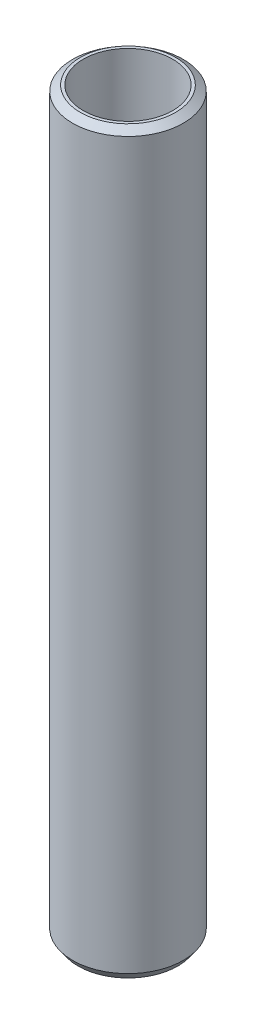
ISO-10303-21;
HEADER;
FILE_DESCRIPTION(('STEP AP214'),'2;1');
FILE_NAME('part.step','',(''),(''),'','','');
FILE_SCHEMA(('AUTOMOTIVE_DESIGN { 1 0 10303 214 1 1 1 1 }'));
ENDSEC;
DATA;
#1=APPLICATION_CONTEXT('core data for automotive mechanical design processes');
#2=APPLICATION_PROTOCOL_DEFINITION('international standard','automotive_design',2000,#1);
#3=PRODUCT_CONTEXT('',#1,'mechanical');
#4=PRODUCT('Part','Part','',(#3));
#5=PRODUCT_RELATED_PRODUCT_CATEGORY('part','',(#4));
#6=PRODUCT_DEFINITION_FORMATION('','',#4);
#7=PRODUCT_DEFINITION_CONTEXT('part definition',#1,'design');
#8=PRODUCT_DEFINITION('design','',#6,#7);
#9=PRODUCT_DEFINITION_SHAPE('','',#8);
#10=(LENGTH_UNIT() NAMED_UNIT(*) SI_UNIT(.MILLI.,.METRE.));
#11=(NAMED_UNIT(*) PLANE_ANGLE_UNIT() SI_UNIT($,.RADIAN.));
#12=(NAMED_UNIT(*) SI_UNIT($,.STERADIAN.) SOLID_ANGLE_UNIT());
#13=UNCERTAINTY_MEASURE_WITH_UNIT(LENGTH_MEASURE(1.E-05),#10,'distance_accuracy_value','');
#14=(GEOMETRIC_REPRESENTATION_CONTEXT(3) GLOBAL_UNCERTAINTY_ASSIGNED_CONTEXT((#13)) GLOBAL_UNIT_ASSIGNED_CONTEXT((#10,
#11,#12)) REPRESENTATION_CONTEXT('',''));
#15=CARTESIAN_POINT('',(0.,0.,0.));
#16=DIRECTION('',(0.,0.,1.));
#17=DIRECTION('',(1.,0.,0.));
#18=AXIS2_PLACEMENT_3D('',#15,#16,#17);
#19=CARTESIAN_POINT('',(0.,600.,0.));
#20=DIRECTION('',(0.,-1.,0.));
#21=DIRECTION('',(0.,0.,-1.));
#22=AXIS2_PLACEMENT_3D('',#19,#20,#21);
#23=CYLINDRICAL_SURFACE('',#22,45.);
#24=CARTESIAN_POINT('',(0.,595.513273647644,0.));
#25=DIRECTION('',(0.,1.,0.));
#26=DIRECTION('',(0.,0.,1.));
#27=AXIS2_PLACEMENT_3D('',#24,#25,#26);
#28=CIRCLE('',#27,45.);
#29=CARTESIAN_POINT('',(0.,595.513273647644,45.));
#30=VERTEX_POINT('',#29);
#31=EDGE_CURVE('E50',#30,#30,#28,.F.);
#32=ORIENTED_EDGE('',*,*,#31,.T.);
#33=EDGE_LOOP('',(#32));
#34=FACE_BOUND('',#33,.T.);
#35=CARTESIAN_POINT('',(0.,6.26625271174019,0.));
#36=DIRECTION('',(0.,1.,0.));
#37=DIRECTION('',(0.,0.,1.));
#38=AXIS2_PLACEMENT_3D('',#35,#36,#37);
#39=CIRCLE('',#38,45.);
#40=CARTESIAN_POINT('',(0.,6.26625271174019,45.));
#41=VERTEX_POINT('',#40);
#42=EDGE_CURVE('E51',#41,#41,#39,.T.);
#43=ORIENTED_EDGE('',*,*,#42,.T.);
#44=EDGE_LOOP('',(#43));
#45=FACE_BOUND('',#44,.T.);
#46=ADVANCED_FACE('F39',(#34,#45),#23,.T.);
#47=CARTESIAN_POINT('',(0.,600.,0.));
#48=DIRECTION('',(0.,1.,0.));
#49=DIRECTION('',(0.,0.,1.));
#50=AXIS2_PLACEMENT_3D('',#47,#48,#49);
#51=PLANE('',#50);
#52=CARTESIAN_POINT('',(0.,600.,0.));
#53=DIRECTION('',(0.,1.,0.));
#54=DIRECTION('',(0.,0.,1.));
#55=AXIS2_PLACEMENT_3D('',#52,#53,#54);
#56=CIRCLE('',#55,38.7337472882597);
#57=CARTESIAN_POINT('',(0.,600.,38.7337472882597));
#58=VERTEX_POINT('',#57);
#59=EDGE_CURVE('E54',#58,#58,#56,.T.);
#60=ORIENTED_EDGE('',*,*,#59,.T.);
#61=EDGE_LOOP('',(#60));
#62=FACE_BOUND('',#61,.T.);
#63=CARTESIAN_POINT('',(0.,600.,0.));
#64=DIRECTION('',(0.,1.,0.));
#65=DIRECTION('',(0.,0.,1.));
#66=AXIS2_PLACEMENT_3D('',#63,#64,#65);
#67=CIRCLE('',#66,36.3207869684112);
#68=CARTESIAN_POINT('',(0.,600.,36.3207869684112));
#69=VERTEX_POINT('',#68);
#70=EDGE_CURVE('E58',#69,#69,#67,.T.);
#71=ORIENTED_EDGE('',*,*,#70,.F.);
#72=EDGE_LOOP('',(#71));
#73=FACE_BOUND('',#72,.T.);
#74=ADVANCED_FACE('F69',(#62,#73),#51,.T.);
#75=CARTESIAN_POINT('',(0.,0.,0.));
#76=DIRECTION('',(0.,1.,0.));
#77=DIRECTION('',(0.,0.,1.));
#78=AXIS2_PLACEMENT_3D('',#75,#76,#77);
#79=PLANE('',#78);
#80=CARTESIAN_POINT('',(0.,0.,0.));
#81=DIRECTION('',(0.,1.,0.));
#82=DIRECTION('',(0.,0.,1.));
#83=AXIS2_PLACEMENT_3D('',#80,#81,#82);
#84=CIRCLE('',#83,40.5132736476445);
#85=CARTESIAN_POINT('',(0.,0.,40.5132736476445));
#86=VERTEX_POINT('',#85);
#87=EDGE_CURVE('E10',#86,#86,#84,.F.);
#88=ORIENTED_EDGE('',*,*,#87,.T.);
#89=EDGE_LOOP('',(#88));
#90=FACE_BOUND('',#89,.T.);
#91=CARTESIAN_POINT('',(0.,0.,0.));
#92=DIRECTION('',(0.,1.,0.));
#93=DIRECTION('',(0.,0.,1.));
#94=AXIS2_PLACEMENT_3D('',#91,#92,#93);
#95=CIRCLE('',#94,36.3207869684112);
#96=CARTESIAN_POINT('',(0.,0.,36.3207869684112));
#97=VERTEX_POINT('',#96);
#98=EDGE_CURVE('E63',#97,#97,#95,.T.);
#99=ORIENTED_EDGE('',*,*,#98,.T.);
#100=EDGE_LOOP('',(#99));
#101=FACE_BOUND('',#100,.T.);
#102=ADVANCED_FACE('F75',(#90,#101),#79,.F.);
#103=CARTESIAN_POINT('',(0.,600.,0.));
#104=DIRECTION('',(0.,-1.,0.));
#105=DIRECTION('',(0.,0.,-1.));
#106=AXIS2_PLACEMENT_3D('',#103,#104,#105);
#107=CYLINDRICAL_SURFACE('',#106,36.3207869684112);
#108=ORIENTED_EDGE('',*,*,#70,.T.);
#109=EDGE_LOOP('',(#108));
#110=FACE_BOUND('',#109,.T.);
#111=ORIENTED_EDGE('',*,*,#98,.F.);
#112=EDGE_LOOP('',(#111));
#113=FACE_BOUND('',#112,.T.);
#114=ADVANCED_FACE('F70',(#110,#113),#107,.F.);
#115=CARTESIAN_POINT('',(0.,600.,0.));
#116=DIRECTION('',(0.,-1.,0.));
#117=DIRECTION('',(0.,0.,-1.));
#118=AXIS2_PLACEMENT_3D('',#115,#116,#117);
#119=CONICAL_SURFACE('',#118,38.7337472882597,0.94940319303886);
#120=ORIENTED_EDGE('',*,*,#31,.F.);
#121=EDGE_LOOP('',(#120));
#122=FACE_BOUND('',#121,.T.);
#123=ORIENTED_EDGE('',*,*,#59,.F.);
#124=EDGE_LOOP('',(#123));
#125=FACE_BOUND('',#124,.T.);
#126=ADVANCED_FACE('F81',(#122,#125),#119,.T.);
#127=CARTESIAN_POINT('',(0.,6.26625271174019,0.));
#128=DIRECTION('',(0.,1.,0.));
#129=DIRECTION('',(0.,0.,1.));
#130=AXIS2_PLACEMENT_3D('',#127,#128,#129);
#131=CONICAL_SURFACE('',#130,45.,0.621393133756045);
#132=ORIENTED_EDGE('',*,*,#87,.F.);
#133=EDGE_LOOP('',(#132));
#134=FACE_BOUND('',#133,.T.);
#135=ORIENTED_EDGE('',*,*,#42,.F.);
#136=EDGE_LOOP('',(#135));
#137=FACE_BOUND('',#136,.T.);
#138=ADVANCED_FACE('F45',(#134,#137),#131,.T.);
#139=CLOSED_SHELL('',(#46,#74,#102,#114,#126,#138));
#140=MANIFOLD_SOLID_BREP('B2',#139);
#141=ADVANCED_BREP_SHAPE_REPRESENTATION('',(#18,#140),#14);
#142=SHAPE_DEFINITION_REPRESENTATION(#9,#141);
ENDSEC;
END-ISO-10303-21;
